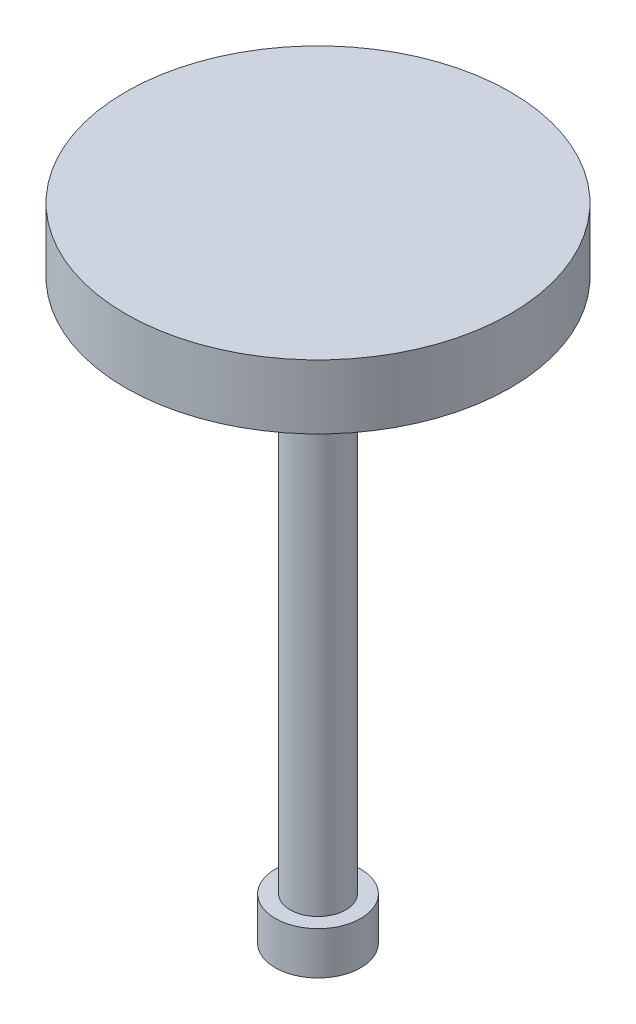
ISO-10303-21;
HEADER;
FILE_DESCRIPTION(('STEP AP214'),'2;1');
FILE_NAME('part.step','',(''),(''),'','','');
FILE_SCHEMA(('AUTOMOTIVE_DESIGN { 1 0 10303 214 1 1 1 1 }'));
ENDSEC;
DATA;
#1=APPLICATION_CONTEXT('core data for automotive mechanical design processes');
#2=APPLICATION_PROTOCOL_DEFINITION('international standard','automotive_design',2000,#1);
#3=PRODUCT_CONTEXT('',#1,'mechanical');
#4=PRODUCT('Part','Part','',(#3));
#5=PRODUCT_RELATED_PRODUCT_CATEGORY('part','',(#4));
#6=PRODUCT_DEFINITION_FORMATION('','',#4);
#7=PRODUCT_DEFINITION_CONTEXT('part definition',#1,'design');
#8=PRODUCT_DEFINITION('design','',#6,#7);
#9=PRODUCT_DEFINITION_SHAPE('','',#8);
#10=(LENGTH_UNIT() NAMED_UNIT(*) SI_UNIT(.MILLI.,.METRE.));
#11=(NAMED_UNIT(*) PLANE_ANGLE_UNIT() SI_UNIT($,.RADIAN.));
#12=(NAMED_UNIT(*) SI_UNIT($,.STERADIAN.) SOLID_ANGLE_UNIT());
#13=UNCERTAINTY_MEASURE_WITH_UNIT(LENGTH_MEASURE(1.E-05),#10,'distance_accuracy_value','');
#14=(GEOMETRIC_REPRESENTATION_CONTEXT(3) GLOBAL_UNCERTAINTY_ASSIGNED_CONTEXT((#13)) GLOBAL_UNIT_ASSIGNED_CONTEXT((#10,
#11,#12)) REPRESENTATION_CONTEXT('',''));
#15=CARTESIAN_POINT('',(0.,0.,0.));
#16=DIRECTION('',(0.,0.,1.));
#17=DIRECTION('',(1.,0.,0.));
#18=AXIS2_PLACEMENT_3D('',#15,#16,#17);
#19=CARTESIAN_POINT('',(0.,-27.,0.));
#20=DIRECTION('',(0.,1.,0.));
#21=DIRECTION('',(0.,0.,1.));
#22=AXIS2_PLACEMENT_3D('',#19,#20,#21);
#23=CYLINDRICAL_SURFACE('',#22,2.);
#24=CARTESIAN_POINT('',(0.,-27.,0.));
#25=DIRECTION('',(0.,1.,0.));
#26=DIRECTION('',(0.,0.,1.));
#27=AXIS2_PLACEMENT_3D('',#24,#25,#26);
#28=CIRCLE('',#27,2.);
#29=CARTESIAN_POINT('',(0.,-27.,2.));
#30=VERTEX_POINT('',#29);
#31=EDGE_CURVE('E10',#30,#30,#28,.T.);
#32=ORIENTED_EDGE('',*,*,#31,.T.);
#33=EDGE_LOOP('',(#32));
#34=FACE_BOUND('',#33,.T.);
#35=CARTESIAN_POINT('',(0.,-25.,0.));
#36=DIRECTION('',(0.,1.,0.));
#37=DIRECTION('',(0.,0.,1.));
#38=AXIS2_PLACEMENT_3D('',#35,#36,#37);
#39=CIRCLE('',#38,2.);
#40=CARTESIAN_POINT('',(0.,-25.,2.));
#41=VERTEX_POINT('',#40);
#42=EDGE_CURVE('E55',#41,#41,#39,.T.);
#43=ORIENTED_EDGE('',*,*,#42,.F.);
#44=EDGE_LOOP('',(#43));
#45=FACE_BOUND('',#44,.T.);
#46=ADVANCED_FACE('F33',(#34,#45),#23,.T.);
#47=CARTESIAN_POINT('',(2.,-27.,0.));
#48=DIRECTION('',(0.,-1.,0.));
#49=DIRECTION('',(0.,0.,-1.));
#50=AXIS2_PLACEMENT_3D('',#47,#48,#49);
#51=PLANE('',#50);
#52=ORIENTED_EDGE('',*,*,#31,.F.);
#53=EDGE_LOOP('',(#52));
#54=FACE_BOUND('',#53,.T.);
#55=ADVANCED_FACE('F63',(#54),#51,.T.);
#56=CARTESIAN_POINT('',(0.,3.,0.));
#57=DIRECTION('',(0.,1.,0.));
#58=DIRECTION('',(0.,0.,1.));
#59=AXIS2_PLACEMENT_3D('',#56,#57,#58);
#60=PLANE('',#59);
#61=CARTESIAN_POINT('',(0.,3.,0.));
#62=DIRECTION('',(0.,1.,0.));
#63=DIRECTION('',(0.,0.,1.));
#64=AXIS2_PLACEMENT_3D('',#61,#62,#63);
#65=CIRCLE('',#64,9.);
#66=CARTESIAN_POINT('',(0.,3.,9.));
#67=VERTEX_POINT('',#66);
#68=EDGE_CURVE('E39',#67,#67,#65,.T.);
#69=ORIENTED_EDGE('',*,*,#68,.T.);
#70=EDGE_LOOP('',(#69));
#71=FACE_BOUND('',#70,.T.);
#72=ADVANCED_FACE('F67',(#71),#60,.T.);
#73=CARTESIAN_POINT('',(0.,-27.,0.));
#74=DIRECTION('',(0.,1.,0.));
#75=DIRECTION('',(0.,0.,1.));
#76=AXIS2_PLACEMENT_3D('',#73,#74,#75);
#77=CYLINDRICAL_SURFACE('',#76,9.);
#78=CARTESIAN_POINT('',(0.,0.,0.));
#79=DIRECTION('',(0.,1.,0.));
#80=DIRECTION('',(0.,0.,1.));
#81=AXIS2_PLACEMENT_3D('',#78,#79,#80);
#82=CIRCLE('',#81,9.);
#83=CARTESIAN_POINT('',(0.,0.,9.));
#84=VERTEX_POINT('',#83);
#85=EDGE_CURVE('E43',#84,#84,#82,.T.);
#86=ORIENTED_EDGE('',*,*,#85,.T.);
#87=EDGE_LOOP('',(#86));
#88=FACE_BOUND('',#87,.T.);
#89=ORIENTED_EDGE('',*,*,#68,.F.);
#90=EDGE_LOOP('',(#89));
#91=FACE_BOUND('',#90,.T.);
#92=ADVANCED_FACE('F72',(#88,#91),#77,.T.);
#93=CARTESIAN_POINT('',(9.,0.,0.));
#94=DIRECTION('',(0.,-1.,0.));
#95=DIRECTION('',(0.,0.,-1.));
#96=AXIS2_PLACEMENT_3D('',#93,#94,#95);
#97=PLANE('',#96);
#98=CARTESIAN_POINT('',(0.,0.,0.));
#99=DIRECTION('',(0.,1.,0.));
#100=DIRECTION('',(0.,0.,1.));
#101=AXIS2_PLACEMENT_3D('',#98,#99,#100);
#102=CIRCLE('',#101,1.305);
#103=CARTESIAN_POINT('',(0.,0.,1.305));
#104=VERTEX_POINT('',#103);
#105=EDGE_CURVE('E47',#104,#104,#102,.T.);
#106=ORIENTED_EDGE('',*,*,#105,.T.);
#107=EDGE_LOOP('',(#106));
#108=FACE_BOUND('',#107,.T.);
#109=ORIENTED_EDGE('',*,*,#85,.F.);
#110=EDGE_LOOP('',(#109));
#111=FACE_BOUND('',#110,.T.);
#112=ADVANCED_FACE('F77',(#108,#111),#97,.T.);
#113=CARTESIAN_POINT('',(0.,-27.,0.));
#114=DIRECTION('',(0.,1.,0.));
#115=DIRECTION('',(0.,0.,1.));
#116=AXIS2_PLACEMENT_3D('',#113,#114,#115);
#117=CYLINDRICAL_SURFACE('',#116,1.305);
#118=CARTESIAN_POINT('',(0.,-25.,0.));
#119=DIRECTION('',(0.,1.,0.));
#120=DIRECTION('',(0.,0.,1.));
#121=AXIS2_PLACEMENT_3D('',#118,#119,#120);
#122=CIRCLE('',#121,1.305);
#123=CARTESIAN_POINT('',(0.,-25.,1.305));
#124=VERTEX_POINT('',#123);
#125=EDGE_CURVE('E52',#124,#124,#122,.T.);
#126=ORIENTED_EDGE('',*,*,#125,.T.);
#127=EDGE_LOOP('',(#126));
#128=FACE_BOUND('',#127,.T.);
#129=ORIENTED_EDGE('',*,*,#105,.F.);
#130=EDGE_LOOP('',(#129));
#131=FACE_BOUND('',#130,.T.);
#132=ADVANCED_FACE('F81',(#128,#131),#117,.T.);
#133=CARTESIAN_POINT('',(1.305,-25.,0.));
#134=DIRECTION('',(0.,1.,0.));
#135=DIRECTION('',(0.,0.,1.));
#136=AXIS2_PLACEMENT_3D('',#133,#134,#135);
#137=PLANE('',#136);
#138=ORIENTED_EDGE('',*,*,#42,.T.);
#139=EDGE_LOOP('',(#138));
#140=FACE_BOUND('',#139,.T.);
#141=ORIENTED_EDGE('',*,*,#125,.F.);
#142=EDGE_LOOP('',(#141));
#143=FACE_BOUND('',#142,.T.);
#144=ADVANCED_FACE('F59',(#140,#143),#137,.T.);
#145=CLOSED_SHELL('',(#46,#55,#72,#92,#112,#132,#144));
#146=MANIFOLD_SOLID_BREP('B2',#145);
#147=ADVANCED_BREP_SHAPE_REPRESENTATION('',(#18,#146),#14);
#148=SHAPE_DEFINITION_REPRESENTATION(#9,#147);
ENDSEC;
END-ISO-10303-21;
